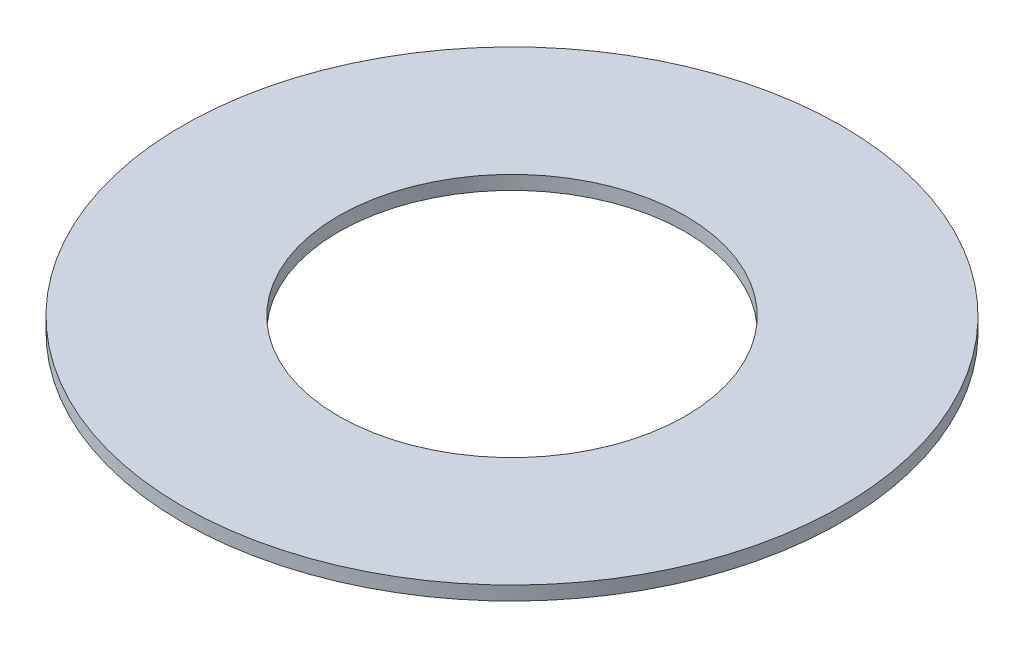
ISO-10303-21;
HEADER;
FILE_DESCRIPTION(('STEP AP214'),'2;1');
FILE_NAME('part.step','',(''),(''),'','','');
FILE_SCHEMA(('AUTOMOTIVE_DESIGN { 1 0 10303 214 1 1 1 1 }'));
ENDSEC;
DATA;
#1=APPLICATION_CONTEXT('core data for automotive mechanical design processes');
#2=APPLICATION_PROTOCOL_DEFINITION('international standard','automotive_design',2000,#1);
#3=PRODUCT_CONTEXT('',#1,'mechanical');
#4=PRODUCT('Part','Part','',(#3));
#5=PRODUCT_RELATED_PRODUCT_CATEGORY('part','',(#4));
#6=PRODUCT_DEFINITION_FORMATION('','',#4);
#7=PRODUCT_DEFINITION_CONTEXT('part definition',#1,'design');
#8=PRODUCT_DEFINITION('design','',#6,#7);
#9=PRODUCT_DEFINITION_SHAPE('','',#8);
#10=(LENGTH_UNIT() NAMED_UNIT(*) SI_UNIT(.MILLI.,.METRE.));
#11=(NAMED_UNIT(*) PLANE_ANGLE_UNIT() SI_UNIT($,.RADIAN.));
#12=(NAMED_UNIT(*) SI_UNIT($,.STERADIAN.) SOLID_ANGLE_UNIT());
#13=UNCERTAINTY_MEASURE_WITH_UNIT(LENGTH_MEASURE(1.E-05),#10,'distance_accuracy_value','');
#14=(GEOMETRIC_REPRESENTATION_CONTEXT(3) GLOBAL_UNCERTAINTY_ASSIGNED_CONTEXT((#13)) GLOBAL_UNIT_ASSIGNED_CONTEXT((#10,
#11,#12)) REPRESENTATION_CONTEXT('',''));
#15=CARTESIAN_POINT('',(0.,0.,0.));
#16=DIRECTION('',(0.,0.,1.));
#17=DIRECTION('',(1.,0.,0.));
#18=AXIS2_PLACEMENT_3D('',#15,#16,#17);
#19=CARTESIAN_POINT('',(0.,4.,0.));
#20=DIRECTION('',(0.,-1.,0.));
#21=DIRECTION('',(0.,0.,-1.));
#22=AXIS2_PLACEMENT_3D('',#19,#20,#21);
#23=CYLINDRICAL_SURFACE('',#22,95.);
#24=CARTESIAN_POINT('',(0.,4.,0.));
#25=DIRECTION('',(0.,1.,0.));
#26=DIRECTION('',(0.,0.,1.));
#27=AXIS2_PLACEMENT_3D('',#24,#25,#26);
#28=CIRCLE('',#27,95.);
#29=CARTESIAN_POINT('',(0.,4.,95.));
#30=VERTEX_POINT('',#29);
#31=EDGE_CURVE('E10',#30,#30,#28,.T.);
#32=ORIENTED_EDGE('',*,*,#31,.F.);
#33=EDGE_LOOP('',(#32));
#34=FACE_BOUND('',#33,.T.);
#35=CARTESIAN_POINT('',(0.,0.,0.));
#36=DIRECTION('',(0.,1.,0.));
#37=DIRECTION('',(0.,0.,1.));
#38=AXIS2_PLACEMENT_3D('',#35,#36,#37);
#39=CIRCLE('',#38,95.);
#40=CARTESIAN_POINT('',(0.,0.,95.));
#41=VERTEX_POINT('',#40);
#42=EDGE_CURVE('E37',#41,#41,#39,.T.);
#43=ORIENTED_EDGE('',*,*,#42,.T.);
#44=EDGE_LOOP('',(#43));
#45=FACE_BOUND('',#44,.T.);
#46=ADVANCED_FACE('F40',(#34,#45),#23,.T.);
#47=CARTESIAN_POINT('',(0.,4.,0.));
#48=DIRECTION('',(0.,1.,0.));
#49=DIRECTION('',(0.,0.,1.));
#50=AXIS2_PLACEMENT_3D('',#47,#48,#49);
#51=PLANE('',#50);
#52=CARTESIAN_POINT('',(0.,4.,0.));
#53=DIRECTION('',(0.,1.,0.));
#54=DIRECTION('',(0.,0.,1.));
#55=AXIS2_PLACEMENT_3D('',#52,#53,#54);
#56=CIRCLE('',#55,50.);
#57=CARTESIAN_POINT('',(0.,4.,50.));
#58=VERTEX_POINT('',#57);
#59=EDGE_CURVE('E50',#58,#58,#56,.T.);
#60=ORIENTED_EDGE('',*,*,#59,.F.);
#61=EDGE_LOOP('',(#60));
#62=FACE_BOUND('',#61,.T.);
#63=ORIENTED_EDGE('',*,*,#31,.T.);
#64=EDGE_LOOP('',(#63));
#65=FACE_BOUND('',#64,.T.);
#66=ADVANCED_FACE('F59',(#62,#65),#51,.T.);
#67=CARTESIAN_POINT('',(0.,0.,0.));
#68=DIRECTION('',(0.,1.,0.));
#69=DIRECTION('',(0.,0.,1.));
#70=AXIS2_PLACEMENT_3D('',#67,#68,#69);
#71=PLANE('',#70);
#72=CARTESIAN_POINT('',(0.,0.,0.));
#73=DIRECTION('',(0.,1.,0.));
#74=DIRECTION('',(0.,0.,1.));
#75=AXIS2_PLACEMENT_3D('',#72,#73,#74);
#76=CIRCLE('',#75,50.);
#77=CARTESIAN_POINT('',(0.,0.,50.));
#78=VERTEX_POINT('',#77);
#79=EDGE_CURVE('E47',#78,#78,#76,.T.);
#80=ORIENTED_EDGE('',*,*,#79,.T.);
#81=EDGE_LOOP('',(#80));
#82=FACE_BOUND('',#81,.T.);
#83=ORIENTED_EDGE('',*,*,#42,.F.);
#84=EDGE_LOOP('',(#83));
#85=FACE_BOUND('',#84,.T.);
#86=ADVANCED_FACE('F58',(#82,#85),#71,.F.);
#87=CARTESIAN_POINT('',(0.,4.,0.));
#88=DIRECTION('',(0.,-1.,0.));
#89=DIRECTION('',(0.,0.,-1.));
#90=AXIS2_PLACEMENT_3D('',#87,#88,#89);
#91=CYLINDRICAL_SURFACE('',#90,50.);
#92=ORIENTED_EDGE('',*,*,#59,.T.);
#93=EDGE_LOOP('',(#92));
#94=FACE_BOUND('',#93,.T.);
#95=ORIENTED_EDGE('',*,*,#79,.F.);
#96=EDGE_LOOP('',(#95));
#97=FACE_BOUND('',#96,.T.);
#98=ADVANCED_FACE('F54',(#94,#97),#91,.F.);
#99=CLOSED_SHELL('',(#46,#66,#86,#98));
#100=MANIFOLD_SOLID_BREP('B2',#99);
#101=ADVANCED_BREP_SHAPE_REPRESENTATION('',(#18,#100),#14);
#102=SHAPE_DEFINITION_REPRESENTATION(#9,#101);
ENDSEC;
END-ISO-10303-21;
